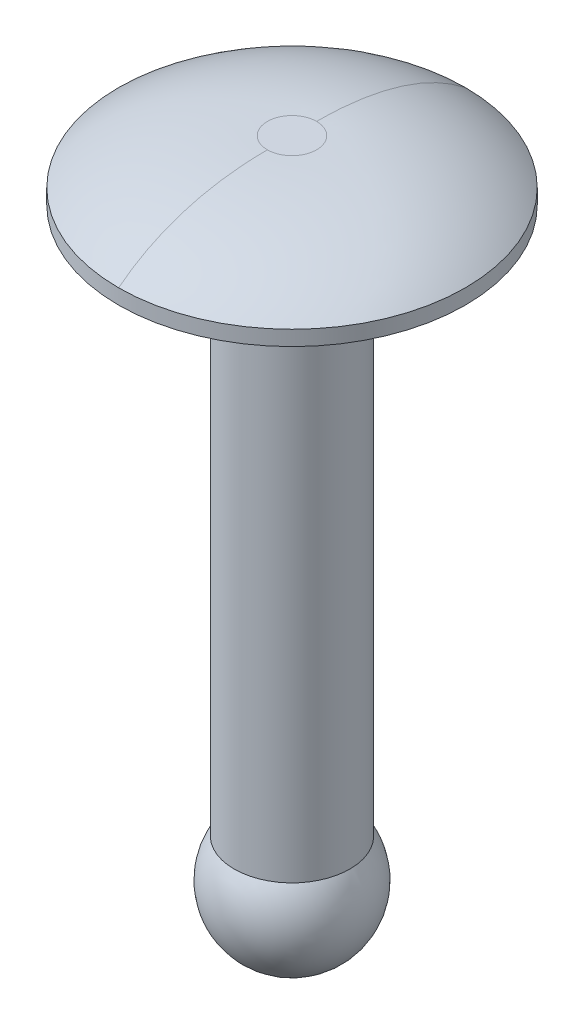
ISO-10303-21;
HEADER;
FILE_DESCRIPTION(('STEP AP214'),'2;1');
FILE_NAME('part.step','',(''),(''),'','','');
FILE_SCHEMA(('AUTOMOTIVE_DESIGN { 1 0 10303 214 1 1 1 1 }'));
ENDSEC;
DATA;
#1=APPLICATION_CONTEXT('core data for automotive mechanical design processes');
#2=APPLICATION_PROTOCOL_DEFINITION('international standard','automotive_design',2000,#1);
#3=PRODUCT_CONTEXT('',#1,'mechanical');
#4=PRODUCT('Part','Part','',(#3));
#5=PRODUCT_RELATED_PRODUCT_CATEGORY('part','',(#4));
#6=PRODUCT_DEFINITION_FORMATION('','',#4);
#7=PRODUCT_DEFINITION_CONTEXT('part definition',#1,'design');
#8=PRODUCT_DEFINITION('design','',#6,#7);
#9=PRODUCT_DEFINITION_SHAPE('','',#8);
#10=(LENGTH_UNIT() NAMED_UNIT(*) SI_UNIT(.MILLI.,.METRE.));
#11=(NAMED_UNIT(*) PLANE_ANGLE_UNIT() SI_UNIT($,.RADIAN.));
#12=(NAMED_UNIT(*) SI_UNIT($,.STERADIAN.) SOLID_ANGLE_UNIT());
#13=UNCERTAINTY_MEASURE_WITH_UNIT(LENGTH_MEASURE(1.E-05),#10,'distance_accuracy_value','');
#14=(GEOMETRIC_REPRESENTATION_CONTEXT(3) GLOBAL_UNCERTAINTY_ASSIGNED_CONTEXT((#13)) GLOBAL_UNIT_ASSIGNED_CONTEXT((#10,
#11,#12)) REPRESENTATION_CONTEXT('',''));
#15=CARTESIAN_POINT('',(0.,0.,0.));
#16=DIRECTION('',(0.,0.,1.));
#17=DIRECTION('',(1.,0.,0.));
#18=AXIS2_PLACEMENT_3D('',#15,#16,#17);
#19=CARTESIAN_POINT('',(0.,1.651,0.));
#20=DIRECTION('',(0.,1.,0.));
#21=DIRECTION('',(0.,0.,1.));
#22=AXIS2_PLACEMENT_3D('',#19,#20,#21);
#23=PLANE('',#22);
#24=CARTESIAN_POINT('',(0.,1.651,-0.67542581426094));
#25=CARTESIAN_POINT('',(1.35085162852188,1.651,-0.675425814260939));
#26=CARTESIAN_POINT('',(1.35085162852188,1.651,0.67542581426094));
#27=CARTESIAN_POINT('',(0.,1.651,0.67542581426094));
#28=(BOUNDED_CURVE() B_SPLINE_CURVE(3,(#24,#25,#26,#27),.UNSPECIFIED.,.F.,
.F.) B_SPLINE_CURVE_WITH_KNOTS((4,4),(0.,1.),
.UNSPECIFIED.) CURVE() GEOMETRIC_REPRESENTATION_ITEM() RATIONAL_B_SPLINE_CURVE((1.,
0.333333333333333,0.333333333333333,1.)) REPRESENTATION_ITEM(''));
#29=CARTESIAN_POINT('',(0.,1.651,0.67542581426092));
#30=VERTEX_POINT('',#29);
#31=CARTESIAN_POINT('',(0.,1.651,-0.67542581426092));
#32=VERTEX_POINT('',#31);
#33=EDGE_CURVE('E90',#30,#32,#28,.F.);
#34=ORIENTED_EDGE('',*,*,#33,.T.);
#35=CARTESIAN_POINT('',(0.,1.651,0.67542581426094));
#36=CARTESIAN_POINT('',(-1.35085162852188,1.651,0.675425814260939));
#37=CARTESIAN_POINT('',(-1.35085162852188,1.651,-0.675425814260941));
#38=CARTESIAN_POINT('',(0.,1.651,-0.67542581426094));
#39=(BOUNDED_CURVE() B_SPLINE_CURVE(3,(#35,#36,#37,#38),.UNSPECIFIED.,.F.,
.F.) B_SPLINE_CURVE_WITH_KNOTS((4,4),(0.,1.),
.UNSPECIFIED.) CURVE() GEOMETRIC_REPRESENTATION_ITEM() RATIONAL_B_SPLINE_CURVE((1.,
0.333333333333333,0.333333333333333,1.)) REPRESENTATION_ITEM(''));
#40=EDGE_CURVE('E61',#32,#30,#39,.F.);
#41=ORIENTED_EDGE('',*,*,#40,.T.);
#42=EDGE_LOOP('',(#34,#41));
#43=FACE_BOUND('',#42,.T.);
#44=ADVANCED_FACE('F16',(#43),#23,.T.);
#45=CARTESIAN_POINT('',(0.,0.412238092319749,4.7625));
#46=CARTESIAN_POINT('',(9.525,0.412238092319749,4.7625));
#47=CARTESIAN_POINT('',(9.525,0.412238092319749,-4.7625));
#48=CARTESIAN_POINT('',(0.,0.412238092319749,-4.7625));
#49=CARTESIAN_POINT('',(0.,1.32452807989022,3.60801731713718));
#50=CARTESIAN_POINT('',(7.21603463427437,1.32452807989022,3.60801731713718));
#51=CARTESIAN_POINT('',(7.21603463427437,1.32452807989022,-3.60801731713718));
#52=CARTESIAN_POINT('',(0.,1.32452807989022,-3.60801731713718));
#53=CARTESIAN_POINT('',(0.,1.651,2.13402886668027));
#54=CARTESIAN_POINT('',(4.26805773336053,1.651,2.13402886668027));
#55=CARTESIAN_POINT('',(4.26805773336053,1.651,-2.13402886668027));
#56=CARTESIAN_POINT('',(0.,1.651,-2.13402886668027));
#57=CARTESIAN_POINT('',(0.,1.651,0.67542581426092));
#58=CARTESIAN_POINT('',(1.35085162852184,1.651,0.67542581426092));
#59=CARTESIAN_POINT('',(1.35085162852184,1.651,-0.67542581426092));
#60=CARTESIAN_POINT('',(0.,1.651,-0.67542581426092));
#61=(BOUNDED_SURFACE() B_SPLINE_SURFACE(3,3,((#45,#46,#47,#48),(#49,#50,#51,#52),(#53,#54,#55,
#56),(#57,#58,#59,#60)),.UNSPECIFIED.,.F.,.F.,.F.) B_SPLINE_SURFACE_WITH_KNOTS((4,4),(4,4),(0.,
1.),(0.,1.),.UNSPECIFIED.) GEOMETRIC_REPRESENTATION_ITEM() RATIONAL_B_SPLINE_SURFACE(((1.,
0.333333333333333,0.333333333333333,1.),(1.,0.333333333333333,0.333333333333333,1.),(1.,
0.333333333333333,0.333333333333333,1.),(1.,0.333333333333333,0.333333333333333,1.))) REPRESENTATION_ITEM('') SURFACE());
#62=CARTESIAN_POINT('',(0.,0.412238092319749,-4.7625));
#63=CARTESIAN_POINT('',(0.,1.32452807989022,-3.60801731713718));
#64=CARTESIAN_POINT('',(0.,1.651,-2.13402886668027));
#65=CARTESIAN_POINT('',(0.,1.651,-0.67542581426092));
#66=B_SPLINE_CURVE_WITH_KNOTS('',3,(#62,#63,#64,#65),.UNSPECIFIED.,.F.,.F.,(4,4),(0.,1.),.UNSPECIFIED.);
#67=CARTESIAN_POINT('',(0.,0.412238092319749,-4.7625));
#68=VERTEX_POINT('',#67);
#69=EDGE_CURVE('E50',#68,#32,#66,.T.);
#70=CARTESIAN_POINT('',(0.,0.412238092319749,4.7625));
#71=CARTESIAN_POINT('',(0.,1.32452807989022,3.60801731713718));
#72=CARTESIAN_POINT('',(0.,1.651,2.13402886668027));
#73=CARTESIAN_POINT('',(0.,1.651,0.67542581426092));
#74=B_SPLINE_CURVE_WITH_KNOTS('',3,(#70,#71,#72,#73),.UNSPECIFIED.,.F.,.F.,(4,4),(0.,1.),.UNSPECIFIED.);
#75=CARTESIAN_POINT('',(0.,0.412238092319749,4.7625));
#76=VERTEX_POINT('',#75);
#77=EDGE_CURVE('E53',#30,#76,#74,.F.);
#78=CARTESIAN_POINT('',(0.,0.412238092319749,0.));
#79=DIRECTION('',(0.,-1.,0.));
#80=DIRECTION('',(0.,0.,-1.));
#81=AXIS2_PLACEMENT_3D('',#78,#79,#80);
#82=CIRCLE('',#81,4.7625);
#83=EDGE_CURVE('E46',#68,#76,#82,.T.);
#84=ORIENTED_EDGE('',*,*,#69,.T.);
#85=ORIENTED_EDGE('',*,*,#33,.F.);
#86=ORIENTED_EDGE('',*,*,#77,.T.);
#87=ORIENTED_EDGE('',*,*,#83,.F.);
#88=EDGE_LOOP('',(#84,#85,#86,#87));
#89=FACE_BOUND('',#88,.T.);
#90=ADVANCED_FACE('F48',(#89),#61,.F.);
#91=CARTESIAN_POINT('',(0.,0.412238092319749,-4.7625));
#92=CARTESIAN_POINT('',(-9.525,0.412238092319749,-4.76250000000001));
#93=CARTESIAN_POINT('',(-9.52500000000001,0.412238092319749,4.7625));
#94=CARTESIAN_POINT('',(0.,0.412238092319749,4.7625));
#95=CARTESIAN_POINT('',(0.,1.32452807989022,-3.60801731713718));
#96=CARTESIAN_POINT('',(-7.21603463427437,1.32452807989022,-3.60801731713719));
#97=CARTESIAN_POINT('',(-7.21603463427437,1.32452807989022,3.60801731713718));
#98=CARTESIAN_POINT('',(0.,1.32452807989022,3.60801731713718));
#99=CARTESIAN_POINT('',(0.,1.651,-2.13402886668027));
#100=CARTESIAN_POINT('',(-4.26805773336053,1.651,-2.13402886668027));
#101=CARTESIAN_POINT('',(-4.26805773336053,1.651,2.13402886668027));
#102=CARTESIAN_POINT('',(0.,1.651,2.13402886668027));
#103=CARTESIAN_POINT('',(0.,1.651,-0.67542581426092));
#104=CARTESIAN_POINT('',(-1.35085162852184,1.651,-0.675425814260921));
#105=CARTESIAN_POINT('',(-1.35085162852184,1.651,0.67542581426092));
#106=CARTESIAN_POINT('',(0.,1.651,0.67542581426092));
#107=(BOUNDED_SURFACE() B_SPLINE_SURFACE(3,3,((#91,#92,#93,#94),(#95,#96,#97,#98),(#99,#100,
#101,#102),(#103,#104,#105,#106)),.UNSPECIFIED.,.F.,.F.,.F.) B_SPLINE_SURFACE_WITH_KNOTS((4,4),
(4,4),(0.,1.),(0.,1.),
.UNSPECIFIED.) GEOMETRIC_REPRESENTATION_ITEM() RATIONAL_B_SPLINE_SURFACE(((1.,0.333333333333333,
0.333333333333333,1.),(1.,0.333333333333333,0.333333333333333,1.),(1.,0.333333333333333,
0.333333333333333,1.),(1.,0.333333333333333,0.333333333333333,1.))) REPRESENTATION_ITEM('') SURFACE());
#108=CARTESIAN_POINT('',(0.,0.412238092319749,0.));
#109=DIRECTION('',(0.,-1.,0.));
#110=DIRECTION('',(0.,0.,-1.));
#111=AXIS2_PLACEMENT_3D('',#108,#109,#110);
#112=CIRCLE('',#111,4.7625);
#113=EDGE_CURVE('E57',#76,#68,#112,.T.);
#114=ORIENTED_EDGE('',*,*,#113,.F.);
#115=ORIENTED_EDGE('',*,*,#77,.F.);
#116=ORIENTED_EDGE('',*,*,#40,.F.);
#117=ORIENTED_EDGE('',*,*,#69,.F.);
#118=EDGE_LOOP('',(#114,#115,#116,#117));
#119=FACE_BOUND('',#118,.T.);
#120=ADVANCED_FACE('F60',(#119),#107,.F.);
#121=CARTESIAN_POINT('',(0.,1.651,0.));
#122=DIRECTION('',(0.,-1.,0.));
#123=DIRECTION('',(0.,0.,-1.));
#124=AXIS2_PLACEMENT_3D('',#121,#122,#123);
#125=CYLINDRICAL_SURFACE('',#124,4.7625);
#126=ORIENTED_EDGE('',*,*,#83,.T.);
#127=ORIENTED_EDGE('',*,*,#113,.T.);
#128=EDGE_LOOP('',(#126,#127));
#129=FACE_BOUND('',#128,.T.);
#130=CARTESIAN_POINT('',(0.,0.,0.));
#131=DIRECTION('',(0.,-1.,0.));
#132=DIRECTION('',(0.,0.,-1.));
#133=AXIS2_PLACEMENT_3D('',#130,#131,#132);
#134=CIRCLE('',#133,4.7625);
#135=CARTESIAN_POINT('',(0.,0.,-4.7625));
#136=VERTEX_POINT('',#135);
#137=EDGE_CURVE('E20',#136,#136,#134,.F.);
#138=ORIENTED_EDGE('',*,*,#137,.T.);
#139=EDGE_LOOP('',(#138));
#140=FACE_BOUND('',#139,.T.);
#141=ADVANCED_FACE('F64',(#129,#140),#125,.T.);
#142=CARTESIAN_POINT('',(0.,-16.0530283709378,0.));
#143=DIRECTION('',(0.,0.,-1.));
#144=DIRECTION('',(0.,-1.,0.));
#145=AXIS2_PLACEMENT_3D('',#142,#143,#144);
#146=SPHERICAL_SURFACE('',#145,1.905);
#147=CARTESIAN_POINT('',(0.,-16.0530283709378,1.905));
#148=VERTEX_POINT('',#147);
#149=VERTEX_LOOP('',#148);
#150=FACE_BOUND('',#149,.T.);
#151=CARTESIAN_POINT('',(0.,-16.0530283709378,-1.905));
#152=VERTEX_POINT('',#151);
#153=VERTEX_LOOP('',#152);
#154=FACE_BOUND('',#153,.T.);
#155=CARTESIAN_POINT('',(0.,-15.,0.));
#156=DIRECTION('',(0.,1.,0.));
#157=DIRECTION('',(0.,0.,1.));
#158=AXIS2_PLACEMENT_3D('',#155,#156,#157);
#159=CIRCLE('',#158,1.5875);
#160=CARTESIAN_POINT('',(0.,-15.,1.5875));
#161=VERTEX_POINT('',#160);
#162=EDGE_CURVE('E26',#161,#161,#159,.T.);
#163=ORIENTED_EDGE('',*,*,#162,.F.);
#164=EDGE_LOOP('',(#163));
#165=FACE_BOUND('',#164,.T.);
#166=ADVANCED_FACE('F150',(#150,#154,#165),#146,.T.);
#167=CARTESIAN_POINT('',(0.,0.,0.));
#168=DIRECTION('',(0.,1.,0.));
#169=DIRECTION('',(0.,0.,1.));
#170=AXIS2_PLACEMENT_3D('',#167,#168,#169);
#171=PLANE('',#170);
#172=ORIENTED_EDGE('',*,*,#137,.F.);
#173=EDGE_LOOP('',(#172));
#174=FACE_BOUND('',#173,.T.);
#175=CARTESIAN_POINT('',(0.,0.,0.));
#176=DIRECTION('',(0.,1.,0.));
#177=DIRECTION('',(0.,0.,1.));
#178=AXIS2_PLACEMENT_3D('',#175,#176,#177);
#179=CIRCLE('',#178,1.5875);
#180=CARTESIAN_POINT('',(0.,0.,1.5875));
#181=VERTEX_POINT('',#180);
#182=EDGE_CURVE('E11',#181,#181,#179,.F.);
#183=ORIENTED_EDGE('',*,*,#182,.F.);
#184=EDGE_LOOP('',(#183));
#185=FACE_BOUND('',#184,.T.);
#186=ADVANCED_FACE('F152',(#174,#185),#171,.F.);
#187=CARTESIAN_POINT('',(0.,-15.,0.));
#188=DIRECTION('',(0.,1.,0.));
#189=DIRECTION('',(0.,0.,1.));
#190=AXIS2_PLACEMENT_3D('',#187,#188,#189);
#191=CYLINDRICAL_SURFACE('',#190,1.5875);
#192=ORIENTED_EDGE('',*,*,#182,.T.);
#193=EDGE_LOOP('',(#192));
#194=FACE_BOUND('',#193,.T.);
#195=ORIENTED_EDGE('',*,*,#162,.T.);
#196=EDGE_LOOP('',(#195));
#197=FACE_BOUND('',#196,.T.);
#198=ADVANCED_FACE('F148',(#194,#197),#191,.T.);
#199=CLOSED_SHELL('',(#44,#90,#120,#141,#166,#186,#198));
#200=MANIFOLD_SOLID_BREP('B1',#199);
#201=ADVANCED_BREP_SHAPE_REPRESENTATION('',(#18,#200),#14);
#202=SHAPE_DEFINITION_REPRESENTATION(#9,#201);
ENDSEC;
END-ISO-10303-21;
